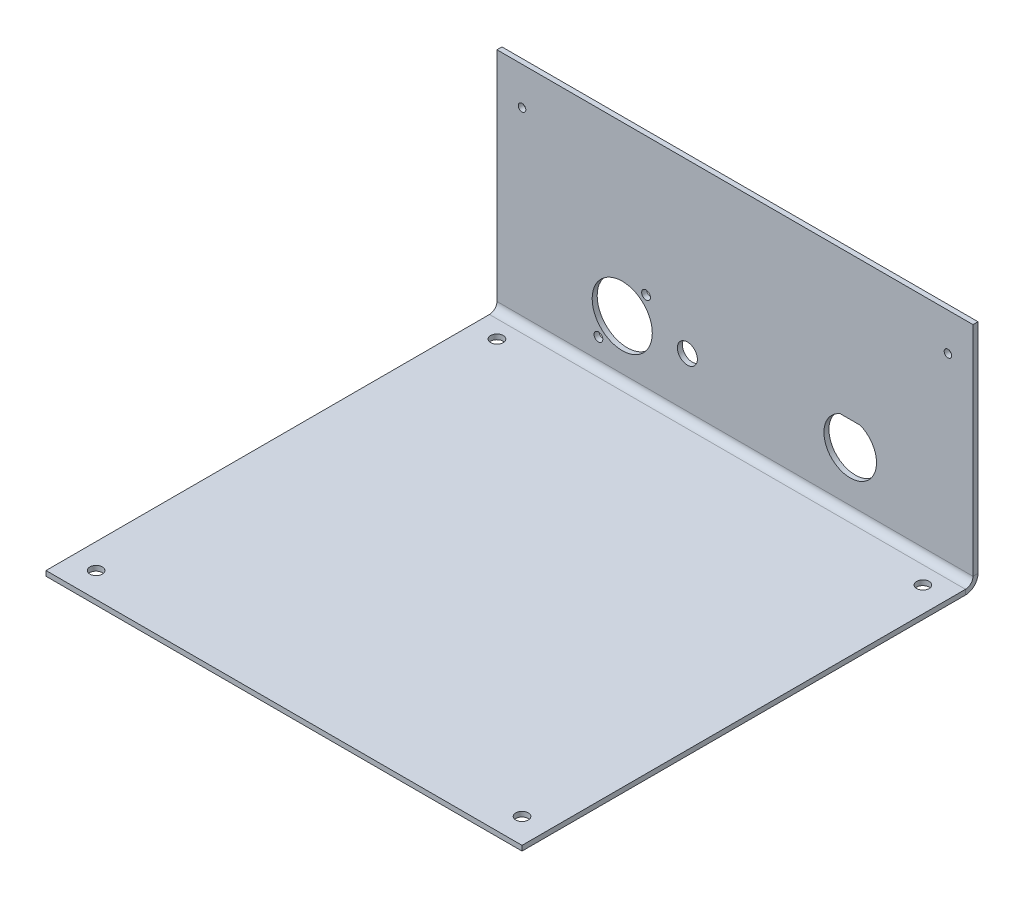
ISO-10303-21;
HEADER;
FILE_DESCRIPTION(('STEP AP214'),'2;1');
FILE_NAME('part.step','',(''),(''),'','','');
FILE_SCHEMA(('AUTOMOTIVE_DESIGN { 1 0 10303 214 1 1 1 1 }'));
ENDSEC;
DATA;
#1=APPLICATION_CONTEXT('core data for automotive mechanical design processes');
#2=APPLICATION_PROTOCOL_DEFINITION('international standard','automotive_design',2000,#1);
#3=PRODUCT_CONTEXT('',#1,'mechanical');
#4=PRODUCT('Part','Part','',(#3));
#5=PRODUCT_RELATED_PRODUCT_CATEGORY('part','',(#4));
#6=PRODUCT_DEFINITION_FORMATION('','',#4);
#7=PRODUCT_DEFINITION_CONTEXT('part definition',#1,'design');
#8=PRODUCT_DEFINITION('design','',#6,#7);
#9=PRODUCT_DEFINITION_SHAPE('','',#8);
#10=(LENGTH_UNIT() NAMED_UNIT(*) SI_UNIT(.MILLI.,.METRE.));
#11=(NAMED_UNIT(*) PLANE_ANGLE_UNIT() SI_UNIT($,.RADIAN.));
#12=(NAMED_UNIT(*) SI_UNIT($,.STERADIAN.) SOLID_ANGLE_UNIT());
#13=UNCERTAINTY_MEASURE_WITH_UNIT(LENGTH_MEASURE(1.E-05),#10,'distance_accuracy_value','');
#14=(GEOMETRIC_REPRESENTATION_CONTEXT(3) GLOBAL_UNCERTAINTY_ASSIGNED_CONTEXT((#13)) GLOBAL_UNIT_ASSIGNED_CONTEXT((#10,
#11,#12)) REPRESENTATION_CONTEXT('',''));
#15=CARTESIAN_POINT('',(0.,0.,0.));
#16=DIRECTION('',(0.,0.,1.));
#17=DIRECTION('',(1.,0.,0.));
#18=AXIS2_PLACEMENT_3D('',#15,#16,#17);
#19=CARTESIAN_POINT('',(95.,3.00000000000003,-90.));
#20=DIRECTION('',(1.,0.,0.));
#21=DIRECTION('',(0.,0.,-1.));
#22=AXIS2_PLACEMENT_3D('',#19,#20,#21);
#23=PLANE('',#22);
#24=DIRECTION('',(0.,0.,-1.));
#25=VECTOR('',#24,1.);
#26=CARTESIAN_POINT('',(95.,3.00000000000003,-90.));
#27=LINE('',#26,#25);
#28=CARTESIAN_POINT('',(95.,3.00000000000003,-90.));
#29=VERTEX_POINT('',#28);
#30=CARTESIAN_POINT('',(95.,3.00000000000003,-92.));
#31=VERTEX_POINT('',#30);
#32=EDGE_CURVE('E11',#29,#31,#27,.T.);
#33=ORIENTED_EDGE('',*,*,#32,.F.);
#34=CARTESIAN_POINT('',(95.,3.00000000000003,-87.));
#35=DIRECTION('',(-1.,0.,0.));
#36=DIRECTION('',(0.,0.,1.));
#37=AXIS2_PLACEMENT_3D('',#34,#35,#36);
#38=CIRCLE('',#37,3.);
#39=CARTESIAN_POINT('',(95.,0.,-86.9999999999999));
#40=VERTEX_POINT('',#39);
#41=EDGE_CURVE('E178',#40,#29,#38,.F.);
#42=ORIENTED_EDGE('',*,*,#41,.F.);
#43=DIRECTION('',(0.,1.,0.));
#44=VECTOR('',#43,1.);
#45=CARTESIAN_POINT('',(95.,-1.99999999999997,-86.9999999999998));
#46=LINE('',#45,#44);
#47=CARTESIAN_POINT('',(95.,-1.99999999999997,-86.9999999999998));
#48=VERTEX_POINT('',#47);
#49=EDGE_CURVE('E45',#48,#40,#46,.T.);
#50=ORIENTED_EDGE('',*,*,#49,.F.);
#51=CARTESIAN_POINT('',(95.,3.00000000000003,-87.));
#52=DIRECTION('',(1.,0.,0.));
#53=DIRECTION('',(0.,0.,-1.));
#54=AXIS2_PLACEMENT_3D('',#51,#52,#53);
#55=CIRCLE('',#54,5.);
#56=EDGE_CURVE('E190',#48,#31,#55,.T.);
#57=ORIENTED_EDGE('',*,*,#56,.T.);
#58=EDGE_LOOP('',(#33,#42,#50,#57));
#59=FACE_BOUND('',#58,.T.);
#60=ADVANCED_FACE('F37',(#59),#23,.T.);
#61=CARTESIAN_POINT('',(95.,-1.99999999999997,-86.9999999999998));
#62=DIRECTION('',(1.,0.,0.));
#63=DIRECTION('',(0.,0.,-1.));
#64=AXIS2_PLACEMENT_3D('',#61,#62,#63);
#65=PLANE('',#64);
#66=DIRECTION('',(0.,1.,0.));
#67=VECTOR('',#66,1.);
#68=CARTESIAN_POINT('',(95.,0.,-90.));
#69=LINE('',#68,#67);
#70=CARTESIAN_POINT('',(95.,90.,-90.));
#71=VERTEX_POINT('',#70);
#72=EDGE_CURVE('E175',#29,#71,#69,.T.);
#73=ORIENTED_EDGE('',*,*,#72,.F.);
#74=ORIENTED_EDGE('',*,*,#32,.T.);
#75=DIRECTION('',(0.,1.,0.));
#76=VECTOR('',#75,1.);
#77=CARTESIAN_POINT('',(95.,0.,-92.));
#78=LINE('',#77,#76);
#79=CARTESIAN_POINT('',(95.,90.,-92.));
#80=VERTEX_POINT('',#79);
#81=EDGE_CURVE('E169',#31,#80,#78,.T.);
#82=ORIENTED_EDGE('',*,*,#81,.T.);
#83=DIRECTION('',(0.,0.,-1.));
#84=VECTOR('',#83,1.);
#85=CARTESIAN_POINT('',(95.,90.,-90.));
#86=LINE('',#85,#84);
#87=EDGE_CURVE('E171',#71,#80,#86,.T.);
#88=ORIENTED_EDGE('',*,*,#87,.F.);
#89=EDGE_LOOP('',(#73,#74,#82,#88));
#90=FACE_BOUND('',#89,.T.);
#91=ADVANCED_FACE('F312',(#90),#65,.T.);
#92=CARTESIAN_POINT('',(-95.,0.,-86.9999999999999));
#93=DIRECTION('',(-1.,0.,0.));
#94=DIRECTION('',(0.,0.,1.));
#95=AXIS2_PLACEMENT_3D('',#92,#93,#94);
#96=PLANE('',#95);
#97=DIRECTION('',(0.,-1.,0.));
#98=VECTOR('',#97,1.);
#99=CARTESIAN_POINT('',(-95.,0.,-86.9999999999999));
#100=LINE('',#99,#98);
#101=CARTESIAN_POINT('',(-95.,0.,-86.9999999999999));
#102=VERTEX_POINT('',#101);
#103=CARTESIAN_POINT('',(-95.,-1.99999999999997,-86.9999999999998));
#104=VERTEX_POINT('',#103);
#105=EDGE_CURVE('E238',#102,#104,#100,.T.);
#106=ORIENTED_EDGE('',*,*,#105,.F.);
#107=CARTESIAN_POINT('',(-95.,3.00000000000003,-87.));
#108=DIRECTION('',(-1.,0.,0.));
#109=DIRECTION('',(0.,0.,1.));
#110=AXIS2_PLACEMENT_3D('',#107,#108,#109);
#111=CIRCLE('',#110,3.);
#112=CARTESIAN_POINT('',(-95.,3.00000000000003,-90.));
#113=VERTEX_POINT('',#112);
#114=EDGE_CURVE('E203',#102,#113,#111,.F.);
#115=ORIENTED_EDGE('',*,*,#114,.T.);
#116=DIRECTION('',(0.,0.,1.));
#117=VECTOR('',#116,1.);
#118=CARTESIAN_POINT('',(-95.,3.00000000000003,-92.));
#119=LINE('',#118,#117);
#120=CARTESIAN_POINT('',(-95.,3.00000000000003,-92.));
#121=VERTEX_POINT('',#120);
#122=EDGE_CURVE('E236',#121,#113,#119,.T.);
#123=ORIENTED_EDGE('',*,*,#122,.F.);
#124=CARTESIAN_POINT('',(-95.,3.00000000000003,-87.));
#125=DIRECTION('',(1.,0.,0.));
#126=DIRECTION('',(0.,0.,-1.));
#127=AXIS2_PLACEMENT_3D('',#124,#125,#126);
#128=CIRCLE('',#127,5.);
#129=EDGE_CURVE('E172',#104,#121,#128,.T.);
#130=ORIENTED_EDGE('',*,*,#129,.F.);
#131=EDGE_LOOP('',(#106,#115,#123,#130));
#132=FACE_BOUND('',#131,.T.);
#133=ADVANCED_FACE('F283',(#132),#96,.T.);
#134=CARTESIAN_POINT('',(-95.,3.00000000000003,-92.));
#135=DIRECTION('',(-1.,0.,0.));
#136=DIRECTION('',(0.,0.,1.));
#137=AXIS2_PLACEMENT_3D('',#134,#135,#136);
#138=PLANE('',#137);
#139=DIRECTION('',(0.,0.,-1.));
#140=VECTOR('',#139,1.);
#141=CARTESIAN_POINT('',(-95.,0.,90.));
#142=LINE('',#141,#140);
#143=CARTESIAN_POINT('',(-95.,0.,90.));
#144=VERTEX_POINT('',#143);
#145=EDGE_CURVE('E206',#144,#102,#142,.T.);
#146=ORIENTED_EDGE('',*,*,#145,.T.);
#147=ORIENTED_EDGE('',*,*,#105,.T.);
#148=DIRECTION('',(0.,0.,-1.));
#149=VECTOR('',#148,1.);
#150=CARTESIAN_POINT('',(-95.,-2.,90.));
#151=LINE('',#150,#149);
#152=CARTESIAN_POINT('',(-95.,-2.,90.));
#153=VERTEX_POINT('',#152);
#154=EDGE_CURVE('E212',#153,#104,#151,.T.);
#155=ORIENTED_EDGE('',*,*,#154,.F.);
#156=DIRECTION('',(0.,1.,0.));
#157=VECTOR('',#156,1.);
#158=CARTESIAN_POINT('',(-95.,-2.,90.));
#159=LINE('',#158,#157);
#160=EDGE_CURVE('E209',#153,#144,#159,.T.);
#161=ORIENTED_EDGE('',*,*,#160,.T.);
#162=EDGE_LOOP('',(#146,#147,#155,#161));
#163=FACE_BOUND('',#162,.T.);
#164=ADVANCED_FACE('F290',(#163),#138,.T.);
#165=CARTESIAN_POINT('',(95.,0.,-92.));
#166=DIRECTION('',(0.,0.,1.));
#167=DIRECTION('',(1.,0.,0.));
#168=AXIS2_PLACEMENT_3D('',#165,#166,#167);
#169=PLANE('',#168);
#170=DIRECTION('',(1.,0.,0.));
#171=VECTOR('',#170,1.);
#172=CARTESIAN_POINT('',(50.0199502484484,32.7,-92.));
#173=LINE('',#172,#171);
#174=CARTESIAN_POINT('',(41.9800497515517,32.7,-92.));
#175=VERTEX_POINT('',#174);
#176=CARTESIAN_POINT('',(50.0199502484484,32.7,-92.));
#177=VERTEX_POINT('',#176);
#178=EDGE_CURVE('E123',#175,#177,#173,.T.);
#179=ORIENTED_EDGE('',*,*,#178,.F.);
#180=CARTESIAN_POINT('',(46.,23.,-92.));
#181=DIRECTION('',(0.,0.,-1.));
#182=DIRECTION('',(-1.,0.,0.));
#183=AXIS2_PLACEMENT_3D('',#180,#181,#182);
#184=CIRCLE('',#183,10.5);
#185=EDGE_CURVE('E53',#177,#175,#184,.T.);
#186=ORIENTED_EDGE('',*,*,#185,.F.);
#187=EDGE_LOOP('',(#179,#186));
#188=FACE_BOUND('',#187,.T.);
#189=CARTESIAN_POINT('',(-19.,23.,-92.));
#190=DIRECTION('',(0.,0.,-1.));
#191=DIRECTION('',(-1.,0.,0.));
#192=AXIS2_PLACEMENT_3D('',#189,#190,#191);
#193=CIRCLE('',#192,4.);
#194=CARTESIAN_POINT('',(-23.,23.,-92.));
#195=VERTEX_POINT('',#194);
#196=EDGE_CURVE('E119',#195,#195,#193,.T.);
#197=ORIENTED_EDGE('',*,*,#196,.F.);
#198=EDGE_LOOP('',(#197));
#199=FACE_BOUND('',#198,.T.);
#200=CARTESIAN_POINT('',(-54.5,11.,-92.));
#201=DIRECTION('',(0.,0.,-1.));
#202=DIRECTION('',(-1.,0.,0.));
#203=AXIS2_PLACEMENT_3D('',#200,#201,#202);
#204=CIRCLE('',#203,1.75);
#205=CARTESIAN_POINT('',(-56.25,11.,-92.));
#206=VERTEX_POINT('',#205);
#207=EDGE_CURVE('E134',#206,#206,#204,.T.);
#208=ORIENTED_EDGE('',*,*,#207,.F.);
#209=EDGE_LOOP('',(#208));
#210=FACE_BOUND('',#209,.T.);
#211=CARTESIAN_POINT('',(-35.5,35.,-92.));
#212=DIRECTION('',(0.,0.,-1.));
#213=DIRECTION('',(-1.,0.,0.));
#214=AXIS2_PLACEMENT_3D('',#211,#212,#213);
#215=CIRCLE('',#214,1.74999999999999);
#216=CARTESIAN_POINT('',(-37.25,35.,-92.));
#217=VERTEX_POINT('',#216);
#218=EDGE_CURVE('E138',#217,#217,#215,.T.);
#219=ORIENTED_EDGE('',*,*,#218,.F.);
#220=EDGE_LOOP('',(#219));
#221=FACE_BOUND('',#220,.T.);
#222=CARTESIAN_POINT('',(-45.,23.,-92.));
#223=DIRECTION('',(0.,0.,-1.));
#224=DIRECTION('',(-1.,0.,0.));
#225=AXIS2_PLACEMENT_3D('',#222,#223,#224);
#226=CIRCLE('',#225,12.);
#227=CARTESIAN_POINT('',(-57.,23.,-92.));
#228=VERTEX_POINT('',#227);
#229=EDGE_CURVE('E142',#228,#228,#226,.T.);
#230=ORIENTED_EDGE('',*,*,#229,.F.);
#231=EDGE_LOOP('',(#230));
#232=FACE_BOUND('',#231,.T.);
#233=CARTESIAN_POINT('',(-85.,75.,-92.));
#234=DIRECTION('',(0.,0.,-1.));
#235=DIRECTION('',(-1.,0.,0.));
#236=AXIS2_PLACEMENT_3D('',#233,#234,#235);
#237=CIRCLE('',#236,1.5);
#238=CARTESIAN_POINT('',(-86.5,75.,-92.));
#239=VERTEX_POINT('',#238);
#240=EDGE_CURVE('E146',#239,#239,#237,.T.);
#241=ORIENTED_EDGE('',*,*,#240,.F.);
#242=EDGE_LOOP('',(#241));
#243=FACE_BOUND('',#242,.T.);
#244=CARTESIAN_POINT('',(85.,75.,-92.));
#245=DIRECTION('',(0.,0.,-1.));
#246=DIRECTION('',(-1.,0.,0.));
#247=AXIS2_PLACEMENT_3D('',#244,#245,#246);
#248=CIRCLE('',#247,1.5);
#249=CARTESIAN_POINT('',(83.5,75.,-92.));
#250=VERTEX_POINT('',#249);
#251=EDGE_CURVE('E150',#250,#250,#248,.T.);
#252=ORIENTED_EDGE('',*,*,#251,.F.);
#253=EDGE_LOOP('',(#252));
#254=FACE_BOUND('',#253,.T.);
#255=DIRECTION('',(0.,1.,0.));
#256=VECTOR('',#255,1.);
#257=CARTESIAN_POINT('',(-95.,0.,-92.));
#258=LINE('',#257,#256);
#259=CARTESIAN_POINT('',(-95.,90.,-92.));
#260=VERTEX_POINT('',#259);
#261=EDGE_CURVE('E194',#121,#260,#258,.T.);
#262=ORIENTED_EDGE('',*,*,#261,.T.);
#263=DIRECTION('',(-1.,0.,0.));
#264=VECTOR('',#263,1.);
#265=CARTESIAN_POINT('',(95.,90.,-92.));
#266=LINE('',#265,#264);
#267=EDGE_CURVE('E234',#80,#260,#266,.T.);
#268=ORIENTED_EDGE('',*,*,#267,.F.);
#269=ORIENTED_EDGE('',*,*,#81,.F.);
#270=DIRECTION('',(-1.,0.,0.));
#271=VECTOR('',#270,1.);
#272=CARTESIAN_POINT('',(95.,3.00000000000003,-92.));
#273=LINE('',#272,#271);
#274=EDGE_CURVE('E193',#31,#121,#273,.T.);
#275=ORIENTED_EDGE('',*,*,#274,.T.);
#276=EDGE_LOOP('',(#262,#268,#269,#275));
#277=FACE_BOUND('',#276,.T.);
#278=ADVANCED_FACE('F319',(#188,#199,#210,#221,#232,#243,#254,#277),#169,.F.);
#279=CARTESIAN_POINT('',(95.,90.,-90.));
#280=DIRECTION('',(0.,1.,0.));
#281=DIRECTION('',(0.,0.,1.));
#282=AXIS2_PLACEMENT_3D('',#279,#280,#281);
#283=PLANE('',#282);
#284=DIRECTION('',(0.,0.,-1.));
#285=VECTOR('',#284,1.);
#286=CARTESIAN_POINT('',(-95.,90.,-90.));
#287=LINE('',#286,#285);
#288=CARTESIAN_POINT('',(-95.,90.,-90.));
#289=VERTEX_POINT('',#288);
#290=EDGE_CURVE('E197',#289,#260,#287,.T.);
#291=ORIENTED_EDGE('',*,*,#290,.F.);
#292=DIRECTION('',(-1.,0.,0.));
#293=VECTOR('',#292,1.);
#294=CARTESIAN_POINT('',(95.,90.,-90.));
#295=LINE('',#294,#293);
#296=EDGE_CURVE('E232',#71,#289,#295,.T.);
#297=ORIENTED_EDGE('',*,*,#296,.F.);
#298=ORIENTED_EDGE('',*,*,#87,.T.);
#299=ORIENTED_EDGE('',*,*,#267,.T.);
#300=EDGE_LOOP('',(#291,#297,#298,#299));
#301=FACE_BOUND('',#300,.T.);
#302=ADVANCED_FACE('F266',(#301),#283,.T.);
#303=CARTESIAN_POINT('',(95.,0.,-90.));
#304=DIRECTION('',(0.,0.,1.));
#305=DIRECTION('',(1.,0.,0.));
#306=AXIS2_PLACEMENT_3D('',#303,#304,#305);
#307=PLANE('',#306);
#308=CARTESIAN_POINT('',(46.,23.,-90.));
#309=DIRECTION('',(0.,0.,1.));
#310=DIRECTION('',(1.,0.,0.));
#311=AXIS2_PLACEMENT_3D('',#308,#309,#310);
#312=CIRCLE('',#311,10.5);
#313=CARTESIAN_POINT('',(50.0199502484484,32.7,-90.));
#314=VERTEX_POINT('',#313);
#315=CARTESIAN_POINT('',(41.9800497515517,32.7,-90.));
#316=VERTEX_POINT('',#315);
#317=EDGE_CURVE('E122',#314,#316,#312,.F.);
#318=ORIENTED_EDGE('',*,*,#317,.T.);
#319=DIRECTION('',(1.,0.,0.));
#320=VECTOR('',#319,1.);
#321=CARTESIAN_POINT('',(50.0199502484484,32.7,-90.));
#322=LINE('',#321,#320);
#323=EDGE_CURVE('E113',#316,#314,#322,.T.);
#324=ORIENTED_EDGE('',*,*,#323,.T.);
#325=EDGE_LOOP('',(#318,#324));
#326=FACE_BOUND('',#325,.T.);
#327=CARTESIAN_POINT('',(-19.,23.,-90.));
#328=DIRECTION('',(0.,0.,1.));
#329=DIRECTION('',(1.,0.,0.));
#330=AXIS2_PLACEMENT_3D('',#327,#328,#329);
#331=CIRCLE('',#330,4.);
#332=CARTESIAN_POINT('',(-15.,23.,-90.));
#333=VERTEX_POINT('',#332);
#334=EDGE_CURVE('E40',#333,#333,#331,.T.);
#335=ORIENTED_EDGE('',*,*,#334,.F.);
#336=EDGE_LOOP('',(#335));
#337=FACE_BOUND('',#336,.T.);
#338=CARTESIAN_POINT('',(-54.5,11.,-90.));
#339=DIRECTION('',(0.,0.,1.));
#340=DIRECTION('',(1.,0.,0.));
#341=AXIS2_PLACEMENT_3D('',#338,#339,#340);
#342=CIRCLE('',#341,1.75);
#343=CARTESIAN_POINT('',(-52.75,11.,-90.));
#344=VERTEX_POINT('',#343);
#345=EDGE_CURVE('E137',#344,#344,#342,.T.);
#346=ORIENTED_EDGE('',*,*,#345,.F.);
#347=EDGE_LOOP('',(#346));
#348=FACE_BOUND('',#347,.T.);
#349=CARTESIAN_POINT('',(-35.5,35.,-90.));
#350=DIRECTION('',(0.,0.,1.));
#351=DIRECTION('',(1.,0.,0.));
#352=AXIS2_PLACEMENT_3D('',#349,#350,#351);
#353=CIRCLE('',#352,1.74999999999999);
#354=CARTESIAN_POINT('',(-33.75,35.,-90.));
#355=VERTEX_POINT('',#354);
#356=EDGE_CURVE('E141',#355,#355,#353,.T.);
#357=ORIENTED_EDGE('',*,*,#356,.F.);
#358=EDGE_LOOP('',(#357));
#359=FACE_BOUND('',#358,.T.);
#360=CARTESIAN_POINT('',(-45.,23.,-90.));
#361=DIRECTION('',(0.,0.,1.));
#362=DIRECTION('',(1.,0.,0.));
#363=AXIS2_PLACEMENT_3D('',#360,#361,#362);
#364=CIRCLE('',#363,12.);
#365=CARTESIAN_POINT('',(-33.,23.,-90.));
#366=VERTEX_POINT('',#365);
#367=EDGE_CURVE('E145',#366,#366,#364,.T.);
#368=ORIENTED_EDGE('',*,*,#367,.F.);
#369=EDGE_LOOP('',(#368));
#370=FACE_BOUND('',#369,.T.);
#371=CARTESIAN_POINT('',(-85.,75.,-90.));
#372=DIRECTION('',(0.,0.,1.));
#373=DIRECTION('',(1.,0.,0.));
#374=AXIS2_PLACEMENT_3D('',#371,#372,#373);
#375=CIRCLE('',#374,1.5);
#376=CARTESIAN_POINT('',(-83.5,75.,-90.));
#377=VERTEX_POINT('',#376);
#378=EDGE_CURVE('E149',#377,#377,#375,.T.);
#379=ORIENTED_EDGE('',*,*,#378,.F.);
#380=EDGE_LOOP('',(#379));
#381=FACE_BOUND('',#380,.T.);
#382=CARTESIAN_POINT('',(85.,75.,-90.));
#383=DIRECTION('',(0.,0.,1.));
#384=DIRECTION('',(1.,0.,0.));
#385=AXIS2_PLACEMENT_3D('',#382,#383,#384);
#386=CIRCLE('',#385,1.5);
#387=CARTESIAN_POINT('',(86.5,75.,-90.));
#388=VERTEX_POINT('',#387);
#389=EDGE_CURVE('E153',#388,#388,#386,.T.);
#390=ORIENTED_EDGE('',*,*,#389,.F.);
#391=EDGE_LOOP('',(#390));
#392=FACE_BOUND('',#391,.T.);
#393=DIRECTION('',(0.,1.,0.));
#394=VECTOR('',#393,1.);
#395=CARTESIAN_POINT('',(-95.,0.,-90.));
#396=LINE('',#395,#394);
#397=EDGE_CURVE('E200',#113,#289,#396,.T.);
#398=ORIENTED_EDGE('',*,*,#397,.F.);
#399=DIRECTION('',(-1.,0.,0.));
#400=VECTOR('',#399,1.);
#401=CARTESIAN_POINT('',(95.,3.00000000000003,-90.));
#402=LINE('',#401,#400);
#403=EDGE_CURVE('E229',#29,#113,#402,.T.);
#404=ORIENTED_EDGE('',*,*,#403,.F.);
#405=ORIENTED_EDGE('',*,*,#72,.T.);
#406=ORIENTED_EDGE('',*,*,#296,.T.);
#407=EDGE_LOOP('',(#398,#404,#405,#406));
#408=FACE_BOUND('',#407,.T.);
#409=ADVANCED_FACE('F125',(#326,#337,#348,#359,#370,#381,#392,#408),#307,.T.);
#410=CARTESIAN_POINT('',(95.,3.00000000000003,-87.));
#411=DIRECTION('',(-1.,0.,0.));
#412=DIRECTION('',(0.,0.,1.));
#413=AXIS2_PLACEMENT_3D('',#410,#411,#412);
#414=CYLINDRICAL_SURFACE('',#413,3.);
#415=ORIENTED_EDGE('',*,*,#114,.F.);
#416=DIRECTION('',(-1.,0.,0.));
#417=VECTOR('',#416,1.);
#418=CARTESIAN_POINT('',(95.,0.,-86.9999999999999));
#419=LINE('',#418,#417);
#420=EDGE_CURVE('E226',#40,#102,#419,.T.);
#421=ORIENTED_EDGE('',*,*,#420,.F.);
#422=ORIENTED_EDGE('',*,*,#41,.T.);
#423=ORIENTED_EDGE('',*,*,#403,.T.);
#424=EDGE_LOOP('',(#415,#421,#422,#423));
#425=FACE_BOUND('',#424,.T.);
#426=ADVANCED_FACE('F265',(#425),#414,.F.);
#427=CARTESIAN_POINT('',(95.,0.,90.));
#428=DIRECTION('',(0.,1.,0.));
#429=DIRECTION('',(0.,0.,1.));
#430=AXIS2_PLACEMENT_3D('',#427,#428,#429);
#431=PLANE('',#430);
#432=CARTESIAN_POINT('',(85.,0.,-80.));
#433=DIRECTION('',(0.,1.,0.));
#434=DIRECTION('',(0.,0.,1.));
#435=AXIS2_PLACEMENT_3D('',#432,#433,#434);
#436=CIRCLE('',#435,2.50000000000001);
#437=CARTESIAN_POINT('',(85.,0.,-77.5));
#438=VERTEX_POINT('',#437);
#439=EDGE_CURVE('E154',#438,#438,#436,.T.);
#440=ORIENTED_EDGE('',*,*,#439,.F.);
#441=EDGE_LOOP('',(#440));
#442=FACE_BOUND('',#441,.T.);
#443=CARTESIAN_POINT('',(85.,0.,80.));
#444=DIRECTION('',(0.,1.,0.));
#445=DIRECTION('',(0.,0.,1.));
#446=AXIS2_PLACEMENT_3D('',#443,#444,#445);
#447=CIRCLE('',#446,2.50000000000001);
#448=CARTESIAN_POINT('',(85.,0.,82.5));
#449=VERTEX_POINT('',#448);
#450=EDGE_CURVE('E158',#449,#449,#447,.T.);
#451=ORIENTED_EDGE('',*,*,#450,.F.);
#452=EDGE_LOOP('',(#451));
#453=FACE_BOUND('',#452,.T.);
#454=CARTESIAN_POINT('',(-85.,0.,80.));
#455=DIRECTION('',(0.,1.,0.));
#456=DIRECTION('',(0.,0.,1.));
#457=AXIS2_PLACEMENT_3D('',#454,#455,#456);
#458=CIRCLE('',#457,2.50000000000001);
#459=CARTESIAN_POINT('',(-85.,0.,82.5));
#460=VERTEX_POINT('',#459);
#461=EDGE_CURVE('E161',#460,#460,#458,.T.);
#462=ORIENTED_EDGE('',*,*,#461,.F.);
#463=EDGE_LOOP('',(#462));
#464=FACE_BOUND('',#463,.T.);
#465=CARTESIAN_POINT('',(-85.,0.,-80.));
#466=DIRECTION('',(0.,1.,0.));
#467=DIRECTION('',(0.,0.,1.));
#468=AXIS2_PLACEMENT_3D('',#465,#466,#467);
#469=CIRCLE('',#468,2.50000000000001);
#470=CARTESIAN_POINT('',(-85.,0.,-77.5));
#471=VERTEX_POINT('',#470);
#472=EDGE_CURVE('E164',#471,#471,#469,.T.);
#473=ORIENTED_EDGE('',*,*,#472,.F.);
#474=EDGE_LOOP('',(#473));
#475=FACE_BOUND('',#474,.T.);
#476=ORIENTED_EDGE('',*,*,#145,.F.);
#477=DIRECTION('',(-1.,0.,0.));
#478=VECTOR('',#477,1.);
#479=CARTESIAN_POINT('',(95.,0.,90.));
#480=LINE('',#479,#478);
#481=CARTESIAN_POINT('',(95.,0.,90.));
#482=VERTEX_POINT('',#481);
#483=EDGE_CURVE('E224',#482,#144,#480,.T.);
#484=ORIENTED_EDGE('',*,*,#483,.F.);
#485=DIRECTION('',(0.,0.,-1.));
#486=VECTOR('',#485,1.);
#487=CARTESIAN_POINT('',(95.,0.,90.));
#488=LINE('',#487,#486);
#489=EDGE_CURVE('E181',#482,#40,#488,.T.);
#490=ORIENTED_EDGE('',*,*,#489,.T.);
#491=ORIENTED_EDGE('',*,*,#420,.T.);
#492=EDGE_LOOP('',(#476,#484,#490,#491));
#493=FACE_BOUND('',#492,.T.);
#494=ADVANCED_FACE('F294',(#442,#453,#464,#475,#493),#431,.T.);
#495=CARTESIAN_POINT('',(95.,-2.,90.));
#496=DIRECTION('',(0.,0.,1.));
#497=DIRECTION('',(1.,0.,0.));
#498=AXIS2_PLACEMENT_3D('',#495,#496,#497);
#499=PLANE('',#498);
#500=ORIENTED_EDGE('',*,*,#160,.F.);
#501=DIRECTION('',(-1.,0.,0.));
#502=VECTOR('',#501,1.);
#503=CARTESIAN_POINT('',(95.,-2.,90.));
#504=LINE('',#503,#502);
#505=CARTESIAN_POINT('',(95.,-2.,90.));
#506=VERTEX_POINT('',#505);
#507=EDGE_CURVE('E222',#506,#153,#504,.T.);
#508=ORIENTED_EDGE('',*,*,#507,.F.);
#509=DIRECTION('',(0.,1.,0.));
#510=VECTOR('',#509,1.);
#511=CARTESIAN_POINT('',(95.,-2.,90.));
#512=LINE('',#511,#510);
#513=EDGE_CURVE('E184',#506,#482,#512,.T.);
#514=ORIENTED_EDGE('',*,*,#513,.T.);
#515=ORIENTED_EDGE('',*,*,#483,.T.);
#516=EDGE_LOOP('',(#500,#508,#514,#515));
#517=FACE_BOUND('',#516,.T.);
#518=ADVANCED_FACE('F300',(#517),#499,.T.);
#519=CARTESIAN_POINT('',(95.,-2.,90.));
#520=DIRECTION('',(0.,1.,0.));
#521=DIRECTION('',(0.,0.,1.));
#522=AXIS2_PLACEMENT_3D('',#519,#520,#521);
#523=PLANE('',#522);
#524=CARTESIAN_POINT('',(85.,-1.99999999999997,-80.));
#525=DIRECTION('',(0.,1.,0.));
#526=DIRECTION('',(0.,0.,1.));
#527=AXIS2_PLACEMENT_3D('',#524,#525,#526);
#528=CIRCLE('',#527,2.50000000000001);
#529=CARTESIAN_POINT('',(85.,-1.99999999999997,-77.5));
#530=VERTEX_POINT('',#529);
#531=EDGE_CURVE('E168',#530,#530,#528,.T.);
#532=ORIENTED_EDGE('',*,*,#531,.T.);
#533=EDGE_LOOP('',(#532));
#534=FACE_BOUND('',#533,.T.);
#535=CARTESIAN_POINT('',(85.,-2.,80.));
#536=DIRECTION('',(0.,1.,0.));
#537=DIRECTION('',(0.,0.,1.));
#538=AXIS2_PLACEMENT_3D('',#535,#536,#537);
#539=CIRCLE('',#538,2.50000000000001);
#540=CARTESIAN_POINT('',(85.,-2.,82.5));
#541=VERTEX_POINT('',#540);
#542=EDGE_CURVE('E245',#541,#541,#539,.T.);
#543=ORIENTED_EDGE('',*,*,#542,.T.);
#544=EDGE_LOOP('',(#543));
#545=FACE_BOUND('',#544,.T.);
#546=CARTESIAN_POINT('',(-85.,-2.,80.));
#547=DIRECTION('',(0.,1.,0.));
#548=DIRECTION('',(0.,0.,1.));
#549=AXIS2_PLACEMENT_3D('',#546,#547,#548);
#550=CIRCLE('',#549,2.50000000000001);
#551=CARTESIAN_POINT('',(-85.,-2.,82.5));
#552=VERTEX_POINT('',#551);
#553=EDGE_CURVE('E157',#552,#552,#550,.T.);
#554=ORIENTED_EDGE('',*,*,#553,.T.);
#555=EDGE_LOOP('',(#554));
#556=FACE_BOUND('',#555,.T.);
#557=CARTESIAN_POINT('',(-85.,-1.99999999999997,-80.));
#558=DIRECTION('',(0.,1.,0.));
#559=DIRECTION('',(0.,0.,1.));
#560=AXIS2_PLACEMENT_3D('',#557,#558,#559);
#561=CIRCLE('',#560,2.50000000000001);
#562=CARTESIAN_POINT('',(-85.,-1.99999999999997,-77.5));
#563=VERTEX_POINT('',#562);
#564=EDGE_CURVE('E167',#563,#563,#561,.T.);
#565=ORIENTED_EDGE('',*,*,#564,.T.);
#566=EDGE_LOOP('',(#565));
#567=FACE_BOUND('',#566,.T.);
#568=ORIENTED_EDGE('',*,*,#154,.T.);
#569=DIRECTION('',(-1.,0.,0.));
#570=VECTOR('',#569,1.);
#571=CARTESIAN_POINT('',(95.,-1.99999999999997,-86.9999999999998));
#572=LINE('',#571,#570);
#573=EDGE_CURVE('E219',#48,#104,#572,.T.);
#574=ORIENTED_EDGE('',*,*,#573,.F.);
#575=DIRECTION('',(0.,0.,-1.));
#576=VECTOR('',#575,1.);
#577=CARTESIAN_POINT('',(95.,-2.,90.));
#578=LINE('',#577,#576);
#579=EDGE_CURVE('E187',#506,#48,#578,.T.);
#580=ORIENTED_EDGE('',*,*,#579,.F.);
#581=ORIENTED_EDGE('',*,*,#507,.T.);
#582=EDGE_LOOP('',(#568,#574,#580,#581));
#583=FACE_BOUND('',#582,.T.);
#584=ADVANCED_FACE('F304',(#534,#545,#556,#567,#583),#523,.F.);
#585=CARTESIAN_POINT('',(95.,3.00000000000003,-87.));
#586=DIRECTION('',(-1.,0.,0.));
#587=DIRECTION('',(0.,0.,1.));
#588=AXIS2_PLACEMENT_3D('',#585,#586,#587);
#589=CYLINDRICAL_SURFACE('',#588,5.);
#590=ORIENTED_EDGE('',*,*,#129,.T.);
#591=ORIENTED_EDGE('',*,*,#274,.F.);
#592=ORIENTED_EDGE('',*,*,#56,.F.);
#593=ORIENTED_EDGE('',*,*,#573,.T.);
#594=EDGE_LOOP('',(#590,#591,#592,#593));
#595=FACE_BOUND('',#594,.T.);
#596=ADVANCED_FACE('F308',(#595),#589,.T.);
#597=CARTESIAN_POINT('',(95.,3.00000000000003,-87.));
#598=DIRECTION('',(-1.,0.,0.));
#599=DIRECTION('',(0.,0.,1.));
#600=AXIS2_PLACEMENT_3D('',#597,#598,#599);
#601=PLANE('',#600);
#602=ORIENTED_EDGE('',*,*,#579,.T.);
#603=ORIENTED_EDGE('',*,*,#49,.T.);
#604=ORIENTED_EDGE('',*,*,#489,.F.);
#605=ORIENTED_EDGE('',*,*,#513,.F.);
#606=EDGE_LOOP('',(#602,#603,#604,#605));
#607=FACE_BOUND('',#606,.T.);
#608=ADVANCED_FACE('F298',(#607),#601,.F.);
#609=CARTESIAN_POINT('',(-95.,3.00000000000003,-87.));
#610=DIRECTION('',(-1.,0.,0.));
#611=DIRECTION('',(0.,0.,1.));
#612=AXIS2_PLACEMENT_3D('',#609,#610,#611);
#613=PLANE('',#612);
#614=ORIENTED_EDGE('',*,*,#261,.F.);
#615=ORIENTED_EDGE('',*,*,#122,.T.);
#616=ORIENTED_EDGE('',*,*,#397,.T.);
#617=ORIENTED_EDGE('',*,*,#290,.T.);
#618=EDGE_LOOP('',(#614,#615,#616,#617));
#619=FACE_BOUND('',#618,.T.);
#620=ADVANCED_FACE('F317',(#619),#613,.T.);
#621=CARTESIAN_POINT('',(-85.,-9.99999999999999,-80.));
#622=DIRECTION('',(0.,1.,0.));
#623=DIRECTION('',(0.,0.,1.));
#624=AXIS2_PLACEMENT_3D('',#621,#622,#623);
#625=CYLINDRICAL_SURFACE('',#624,2.50000000000001);
#626=ORIENTED_EDGE('',*,*,#472,.T.);
#627=EDGE_LOOP('',(#626));
#628=FACE_BOUND('',#627,.T.);
#629=ORIENTED_EDGE('',*,*,#564,.F.);
#630=EDGE_LOOP('',(#629));
#631=FACE_BOUND('',#630,.T.);
#632=ADVANCED_FACE('F403',(#628,#631),#625,.F.);
#633=CARTESIAN_POINT('',(-85.,-10.,80.));
#634=DIRECTION('',(0.,1.,0.));
#635=DIRECTION('',(0.,0.,1.));
#636=AXIS2_PLACEMENT_3D('',#633,#634,#635);
#637=CYLINDRICAL_SURFACE('',#636,2.50000000000001);
#638=ORIENTED_EDGE('',*,*,#461,.T.);
#639=EDGE_LOOP('',(#638));
#640=FACE_BOUND('',#639,.T.);
#641=ORIENTED_EDGE('',*,*,#553,.F.);
#642=EDGE_LOOP('',(#641));
#643=FACE_BOUND('',#642,.T.);
#644=ADVANCED_FACE('F413',(#640,#643),#637,.F.);
#645=CARTESIAN_POINT('',(85.,-10.,80.));
#646=DIRECTION('',(0.,1.,0.));
#647=DIRECTION('',(0.,0.,1.));
#648=AXIS2_PLACEMENT_3D('',#645,#646,#647);
#649=CYLINDRICAL_SURFACE('',#648,2.50000000000001);
#650=ORIENTED_EDGE('',*,*,#450,.T.);
#651=EDGE_LOOP('',(#650));
#652=FACE_BOUND('',#651,.T.);
#653=ORIENTED_EDGE('',*,*,#542,.F.);
#654=EDGE_LOOP('',(#653));
#655=FACE_BOUND('',#654,.T.);
#656=ADVANCED_FACE('F439',(#652,#655),#649,.F.);
#657=CARTESIAN_POINT('',(85.,-9.99999999999999,-80.));
#658=DIRECTION('',(0.,1.,0.));
#659=DIRECTION('',(0.,0.,1.));
#660=AXIS2_PLACEMENT_3D('',#657,#658,#659);
#661=CYLINDRICAL_SURFACE('',#660,2.50000000000001);
#662=ORIENTED_EDGE('',*,*,#439,.T.);
#663=EDGE_LOOP('',(#662));
#664=FACE_BOUND('',#663,.T.);
#665=ORIENTED_EDGE('',*,*,#531,.F.);
#666=EDGE_LOOP('',(#665));
#667=FACE_BOUND('',#666,.T.);
#668=ADVANCED_FACE('F449',(#664,#667),#661,.F.);
#669=CARTESIAN_POINT('',(85.,75.,-82.));
#670=DIRECTION('',(0.,0.,-1.));
#671=DIRECTION('',(-1.,0.,0.));
#672=AXIS2_PLACEMENT_3D('',#669,#670,#671);
#673=CYLINDRICAL_SURFACE('',#672,1.5);
#674=ORIENTED_EDGE('',*,*,#389,.T.);
#675=EDGE_LOOP('',(#674));
#676=FACE_BOUND('',#675,.T.);
#677=ORIENTED_EDGE('',*,*,#251,.T.);
#678=EDGE_LOOP('',(#677));
#679=FACE_BOUND('',#678,.T.);
#680=ADVANCED_FACE('F459',(#676,#679),#673,.F.);
#681=CARTESIAN_POINT('',(-85.,75.,-82.));
#682=DIRECTION('',(0.,0.,-1.));
#683=DIRECTION('',(-1.,0.,0.));
#684=AXIS2_PLACEMENT_3D('',#681,#682,#683);
#685=CYLINDRICAL_SURFACE('',#684,1.5);
#686=ORIENTED_EDGE('',*,*,#378,.T.);
#687=EDGE_LOOP('',(#686));
#688=FACE_BOUND('',#687,.T.);
#689=ORIENTED_EDGE('',*,*,#240,.T.);
#690=EDGE_LOOP('',(#689));
#691=FACE_BOUND('',#690,.T.);
#692=ADVANCED_FACE('F469',(#688,#691),#685,.F.);
#693=CARTESIAN_POINT('',(-45.,23.,-82.));
#694=DIRECTION('',(0.,0.,-1.));
#695=DIRECTION('',(-1.,0.,0.));
#696=AXIS2_PLACEMENT_3D('',#693,#694,#695);
#697=CYLINDRICAL_SURFACE('',#696,12.);
#698=ORIENTED_EDGE('',*,*,#367,.T.);
#699=EDGE_LOOP('',(#698));
#700=FACE_BOUND('',#699,.T.);
#701=ORIENTED_EDGE('',*,*,#229,.T.);
#702=EDGE_LOOP('',(#701));
#703=FACE_BOUND('',#702,.T.);
#704=ADVANCED_FACE('F479',(#700,#703),#697,.F.);
#705=CARTESIAN_POINT('',(-35.5,35.,-82.));
#706=DIRECTION('',(0.,0.,-1.));
#707=DIRECTION('',(-1.,0.,0.));
#708=AXIS2_PLACEMENT_3D('',#705,#706,#707);
#709=CYLINDRICAL_SURFACE('',#708,1.74999999999999);
#710=ORIENTED_EDGE('',*,*,#356,.T.);
#711=EDGE_LOOP('',(#710));
#712=FACE_BOUND('',#711,.T.);
#713=ORIENTED_EDGE('',*,*,#218,.T.);
#714=EDGE_LOOP('',(#713));
#715=FACE_BOUND('',#714,.T.);
#716=ADVANCED_FACE('F489',(#712,#715),#709,.F.);
#717=CARTESIAN_POINT('',(-54.5,11.,-82.));
#718=DIRECTION('',(0.,0.,-1.));
#719=DIRECTION('',(-1.,0.,0.));
#720=AXIS2_PLACEMENT_3D('',#717,#718,#719);
#721=CYLINDRICAL_SURFACE('',#720,1.75);
#722=ORIENTED_EDGE('',*,*,#345,.T.);
#723=EDGE_LOOP('',(#722));
#724=FACE_BOUND('',#723,.T.);
#725=ORIENTED_EDGE('',*,*,#207,.T.);
#726=EDGE_LOOP('',(#725));
#727=FACE_BOUND('',#726,.T.);
#728=ADVANCED_FACE('F260',(#724,#727),#721,.F.);
#729=CARTESIAN_POINT('',(-19.,23.,-82.));
#730=DIRECTION('',(0.,0.,-1.));
#731=DIRECTION('',(-1.,0.,0.));
#732=AXIS2_PLACEMENT_3D('',#729,#730,#731);
#733=CYLINDRICAL_SURFACE('',#732,4.);
#734=ORIENTED_EDGE('',*,*,#334,.T.);
#735=EDGE_LOOP('',(#734));
#736=FACE_BOUND('',#735,.T.);
#737=ORIENTED_EDGE('',*,*,#196,.T.);
#738=EDGE_LOOP('',(#737));
#739=FACE_BOUND('',#738,.T.);
#740=ADVANCED_FACE('F508',(#736,#739),#733,.F.);
#741=CARTESIAN_POINT('',(46.,23.,90.001));
#742=DIRECTION('',(0.,0.,-1.));
#743=DIRECTION('',(-1.,0.,0.));
#744=AXIS2_PLACEMENT_3D('',#741,#742,#743);
#745=CYLINDRICAL_SURFACE('',#744,10.5);
#746=DIRECTION('',(0.,0.,-1.));
#747=VECTOR('',#746,1.);
#748=CARTESIAN_POINT('',(50.0199502484484,32.7,90.001));
#749=LINE('',#748,#747);
#750=EDGE_CURVE('E60',#314,#177,#749,.T.);
#751=ORIENTED_EDGE('',*,*,#750,.T.);
#752=ORIENTED_EDGE('',*,*,#185,.T.);
#753=DIRECTION('',(0.,0.,-1.));
#754=VECTOR('',#753,1.);
#755=CARTESIAN_POINT('',(41.9800497515517,32.7,90.001));
#756=LINE('',#755,#754);
#757=EDGE_CURVE('E115',#316,#175,#756,.T.);
#758=ORIENTED_EDGE('',*,*,#757,.F.);
#759=ORIENTED_EDGE('',*,*,#317,.F.);
#760=EDGE_LOOP('',(#751,#752,#758,#759));
#761=FACE_BOUND('',#760,.T.);
#762=ADVANCED_FACE('F121',(#761),#745,.F.);
#763=CARTESIAN_POINT('',(50.0199502484484,32.7,90.001));
#764=DIRECTION('',(0.,1.,0.));
#765=DIRECTION('',(0.,0.,1.));
#766=AXIS2_PLACEMENT_3D('',#763,#764,#765);
#767=PLANE('',#766);
#768=ORIENTED_EDGE('',*,*,#757,.T.);
#769=ORIENTED_EDGE('',*,*,#178,.T.);
#770=ORIENTED_EDGE('',*,*,#750,.F.);
#771=ORIENTED_EDGE('',*,*,#323,.F.);
#772=EDGE_LOOP('',(#768,#769,#770,#771));
#773=FACE_BOUND('',#772,.T.);
#774=ADVANCED_FACE('F114',(#773),#767,.F.);
#775=CLOSED_SHELL('',(#60,#91,#133,#164,#278,#302,#409,#426,#494,#518,#584,#596,#608,#620,#632,
#644,#656,#668,#680,#692,#704,#716,#728,#740,#762,#774));
#776=MANIFOLD_SOLID_BREP('B2',#775);
#777=ADVANCED_BREP_SHAPE_REPRESENTATION('',(#18,#776),#14);
#778=SHAPE_DEFINITION_REPRESENTATION(#9,#777);
ENDSEC;
END-ISO-10303-21;
